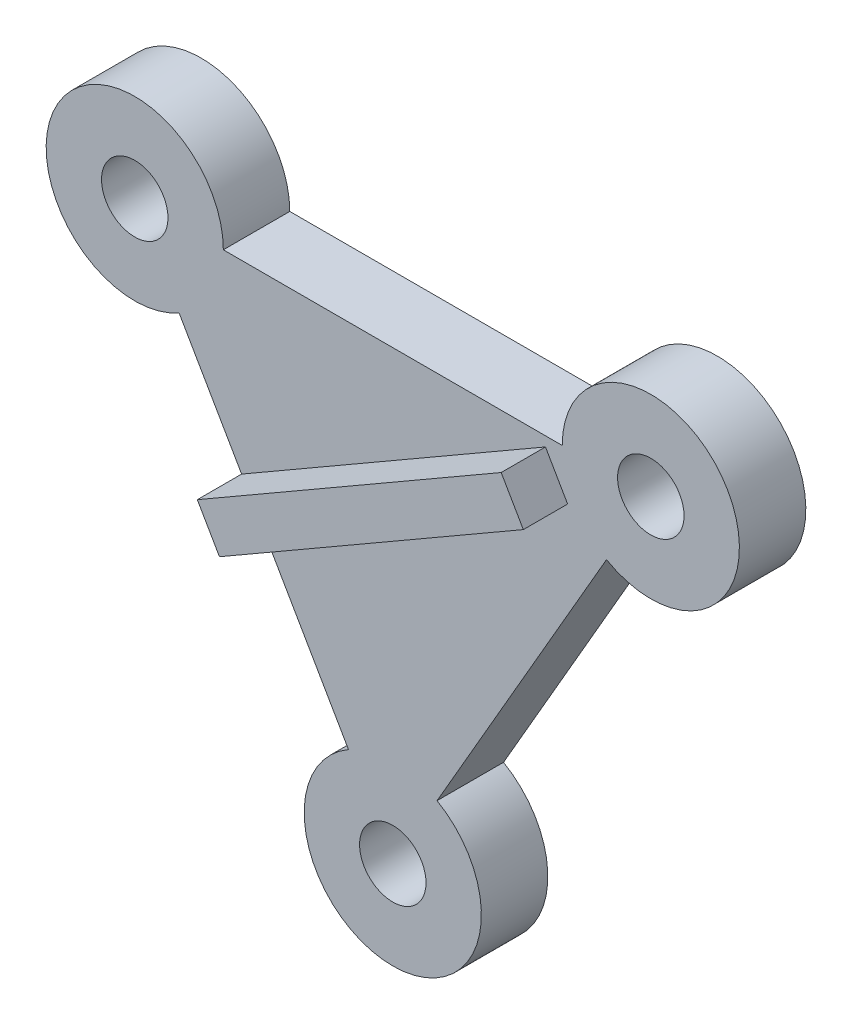
ISO-10303-21;
HEADER;
FILE_DESCRIPTION(('STEP AP214'),'2;1');
FILE_NAME('part.step','',(''),(''),'','','');
FILE_SCHEMA(('AUTOMOTIVE_DESIGN { 1 0 10303 214 1 1 1 1 }'));
ENDSEC;
DATA;
#1=APPLICATION_CONTEXT('core data for automotive mechanical design processes');
#2=APPLICATION_PROTOCOL_DEFINITION('international standard','automotive_design',2000,#1);
#3=PRODUCT_CONTEXT('',#1,'mechanical');
#4=PRODUCT('Part','Part','',(#3));
#5=PRODUCT_RELATED_PRODUCT_CATEGORY('part','',(#4));
#6=PRODUCT_DEFINITION_FORMATION('','',#4);
#7=PRODUCT_DEFINITION_CONTEXT('part definition',#1,'design');
#8=PRODUCT_DEFINITION('design','',#6,#7);
#9=PRODUCT_DEFINITION_SHAPE('','',#8);
#10=(LENGTH_UNIT() NAMED_UNIT(*) SI_UNIT(.MILLI.,.METRE.));
#11=(NAMED_UNIT(*) PLANE_ANGLE_UNIT() SI_UNIT($,.RADIAN.));
#12=(NAMED_UNIT(*) SI_UNIT($,.STERADIAN.) SOLID_ANGLE_UNIT());
#13=UNCERTAINTY_MEASURE_WITH_UNIT(LENGTH_MEASURE(1.E-05),#10,'distance_accuracy_value','');
#14=(GEOMETRIC_REPRESENTATION_CONTEXT(3) GLOBAL_UNCERTAINTY_ASSIGNED_CONTEXT((#13)) GLOBAL_UNIT_ASSIGNED_CONTEXT((#10,
#11,#12)) REPRESENTATION_CONTEXT('',''));
#15=CARTESIAN_POINT('',(0.,0.,0.));
#16=DIRECTION('',(0.,0.,1.));
#17=DIRECTION('',(1.,0.,0.));
#18=AXIS2_PLACEMENT_3D('',#15,#16,#17);
#19=CARTESIAN_POINT('',(-17.7830320131369,30.8264952926154,3.));
#20=DIRECTION('',(0.,0.,1.));
#21=DIRECTION('',(1.,0.,0.));
#22=AXIS2_PLACEMENT_3D('',#19,#20,#21);
#23=PLANE('',#22);
#24=DIRECTION('',(0.866025403784439,0.5,0.));
#25=VECTOR('',#24,1.);
#26=CARTESIAN_POINT('',(1.76091941911627,28.6579396409374,3.));
#27=LINE('',#26,#25);
#28=CARTESIAN_POINT('',(-11.9580320131369,20.7372993385267,3.));
#29=VERTEX_POINT('',#28);
#30=CARTESIAN_POINT('',(1.76091941911627,28.6579396409374,3.));
#31=VERTEX_POINT('',#30);
#32=EDGE_CURVE('E57',#29,#31,#27,.T.);
#33=ORIENTED_EDGE('',*,*,#32,.F.);
#34=DIRECTION('',(0.5,-0.866025403784439,0.));
#35=VECTOR('',#34,1.);
#36=CARTESIAN_POINT('',(-15.7830320131369,27.3623936774776,3.));
#37=LINE('',#36,#35);
#38=CARTESIAN_POINT('',(-8.1330320131369,14.1122049995757,3.));
#39=VERTEX_POINT('',#38);
#40=EDGE_CURVE('E161',#29,#39,#37,.T.);
#41=ORIENTED_EDGE('',*,*,#40,.T.);
#42=CARTESIAN_POINT('',(-6.1330320131369,10.648103384438,3.));
#43=DIRECTION('',(0.,0.,1.));
#44=DIRECTION('',(-1.,0.,0.));
#45=AXIS2_PLACEMENT_3D('',#42,#43,#44);
#46=CIRCLE('',#45,4.);
#47=CARTESIAN_POINT('',(-4.13303201313691,14.1122049995757,3.));
#48=VERTEX_POINT('',#47);
#49=EDGE_CURVE('E165',#39,#48,#46,.T.);
#50=ORIENTED_EDGE('',*,*,#49,.T.);
#51=DIRECTION('',(0.5,0.866025403784439,0.));
#52=VECTOR('',#51,1.);
#53=CARTESIAN_POINT('',(3.51696798686309,27.3623936774776,3.));
#54=LINE('',#53,#52);
#55=CARTESIAN_POINT('',(3.51696798686309,27.3623936774776,3.));
#56=VERTEX_POINT('',#55);
#57=EDGE_CURVE('E201',#48,#56,#54,.T.);
#58=ORIENTED_EDGE('',*,*,#57,.T.);
#59=CARTESIAN_POINT('',(5.5169679868631,30.8264952926154,3.));
#60=DIRECTION('',(0.,0.,1.));
#61=DIRECTION('',(-1.,0.,0.));
#62=AXIS2_PLACEMENT_3D('',#59,#60,#61);
#63=CIRCLE('',#62,4.);
#64=CARTESIAN_POINT('',(1.5169679868631,30.8264952926154,3.));
#65=VERTEX_POINT('',#64);
#66=EDGE_CURVE('E200',#56,#65,#63,.T.);
#67=ORIENTED_EDGE('',*,*,#66,.T.);
#68=DIRECTION('',(-1.,0.,0.));
#69=VECTOR('',#68,1.);
#70=CARTESIAN_POINT('',(-13.7830320131369,30.8264952926154,3.));
#71=LINE('',#70,#69);
#72=CARTESIAN_POINT('',(-13.7830320131369,30.8264952926154,3.));
#73=VERTEX_POINT('',#72);
#74=EDGE_CURVE('E187',#65,#73,#71,.T.);
#75=ORIENTED_EDGE('',*,*,#74,.T.);
#76=CARTESIAN_POINT('',(-17.7830320131369,30.8264952926154,3.));
#77=DIRECTION('',(0.,0.,1.));
#78=DIRECTION('',(1.,0.,0.));
#79=AXIS2_PLACEMENT_3D('',#76,#77,#78);
#80=CIRCLE('',#79,4.);
#81=CARTESIAN_POINT('',(-15.7830320131369,27.3623936774776,3.));
#82=VERTEX_POINT('',#81);
#83=EDGE_CURVE('E158',#73,#82,#80,.T.);
#84=ORIENTED_EDGE('',*,*,#83,.T.);
#85=CARTESIAN_POINT('',(-12.9580320131369,22.4693501460956,3.));
#86=VERTEX_POINT('',#85);
#87=EDGE_CURVE('E171',#82,#86,#37,.T.);
#88=ORIENTED_EDGE('',*,*,#87,.T.);
#89=DIRECTION('',(-0.866025403784439,-0.5,0.));
#90=VECTOR('',#89,1.);
#91=CARTESIAN_POINT('',(-12.9580320131369,22.4693501460956,3.));
#92=LINE('',#91,#90);
#93=CARTESIAN_POINT('',(0.760919419116271,30.3899904485063,3.));
#94=VERTEX_POINT('',#93);
#95=EDGE_CURVE('E131',#94,#86,#92,.T.);
#96=ORIENTED_EDGE('',*,*,#95,.F.);
#97=DIRECTION('',(-0.499999999999999,0.866025403784439,0.));
#98=VECTOR('',#97,1.);
#99=CARTESIAN_POINT('',(0.760919419116271,30.3899904485063,3.));
#100=LINE('',#99,#98);
#101=EDGE_CURVE('E52',#31,#94,#100,.T.);
#102=ORIENTED_EDGE('',*,*,#101,.F.);
#103=EDGE_LOOP('',(#33,#41,#50,#58,#67,#75,#84,#88,#96,#102));
#104=FACE_BOUND('',#103,.T.);
#105=CARTESIAN_POINT('',(5.5169679868631,30.8264952926154,3.));
#106=DIRECTION('',(0.,0.,1.));
#107=DIRECTION('',(1.,0.,0.));
#108=AXIS2_PLACEMENT_3D('',#105,#106,#107);
#109=CIRCLE('',#108,1.5);
#110=CARTESIAN_POINT('',(7.01696798686309,30.8264952926154,3.));
#111=VERTEX_POINT('',#110);
#112=EDGE_CURVE('E146',#111,#111,#109,.T.);
#113=ORIENTED_EDGE('',*,*,#112,.F.);
#114=EDGE_LOOP('',(#113));
#115=FACE_BOUND('',#114,.T.);
#116=CARTESIAN_POINT('',(-17.7830320131369,30.8264952926154,3.));
#117=DIRECTION('',(0.,0.,1.));
#118=DIRECTION('',(1.,0.,0.));
#119=AXIS2_PLACEMENT_3D('',#116,#117,#118);
#120=CIRCLE('',#119,1.5);
#121=CARTESIAN_POINT('',(-16.2830320131369,30.8264952926154,3.));
#122=VERTEX_POINT('',#121);
#123=EDGE_CURVE('E152',#122,#122,#120,.T.);
#124=ORIENTED_EDGE('',*,*,#123,.F.);
#125=EDGE_LOOP('',(#124));
#126=FACE_BOUND('',#125,.T.);
#127=CARTESIAN_POINT('',(-6.1330320131369,10.648103384438,3.));
#128=DIRECTION('',(0.,0.,1.));
#129=DIRECTION('',(1.,0.,0.));
#130=AXIS2_PLACEMENT_3D('',#127,#128,#129);
#131=CIRCLE('',#130,1.5);
#132=CARTESIAN_POINT('',(-4.6330320131369,10.648103384438,3.));
#133=VERTEX_POINT('',#132);
#134=EDGE_CURVE('E137',#133,#133,#131,.T.);
#135=ORIENTED_EDGE('',*,*,#134,.F.);
#136=EDGE_LOOP('',(#135));
#137=FACE_BOUND('',#136,.T.);
#138=ADVANCED_FACE('F35',(#104,#115,#126,#137),#23,.T.);
#139=CARTESIAN_POINT('',(-17.7830320131369,30.8264952926154,0.));
#140=DIRECTION('',(0.,0.,1.));
#141=DIRECTION('',(1.,0.,0.));
#142=AXIS2_PLACEMENT_3D('',#139,#140,#141);
#143=PLANE('',#142);
#144=CARTESIAN_POINT('',(5.5169679868631,30.8264952926154,0.));
#145=DIRECTION('',(0.,0.,1.));
#146=DIRECTION('',(1.,0.,0.));
#147=AXIS2_PLACEMENT_3D('',#144,#145,#146);
#148=CIRCLE('',#147,1.5);
#149=CARTESIAN_POINT('',(7.01696798686309,30.8264952926154,0.));
#150=VERTEX_POINT('',#149);
#151=EDGE_CURVE('E144',#150,#150,#148,.T.);
#152=ORIENTED_EDGE('',*,*,#151,.T.);
#153=EDGE_LOOP('',(#152));
#154=FACE_BOUND('',#153,.T.);
#155=CARTESIAN_POINT('',(-17.7830320131369,30.8264952926154,0.));
#156=DIRECTION('',(0.,0.,1.));
#157=DIRECTION('',(1.,0.,0.));
#158=AXIS2_PLACEMENT_3D('',#155,#156,#157);
#159=CIRCLE('',#158,4.);
#160=CARTESIAN_POINT('',(-13.7830320131369,30.8264952926154,0.));
#161=VERTEX_POINT('',#160);
#162=CARTESIAN_POINT('',(-15.7830320131369,27.3623936774776,0.));
#163=VERTEX_POINT('',#162);
#164=EDGE_CURVE('E155',#161,#163,#159,.T.);
#165=ORIENTED_EDGE('',*,*,#164,.F.);
#166=DIRECTION('',(-1.,0.,0.));
#167=VECTOR('',#166,1.);
#168=CARTESIAN_POINT('',(-13.7830320131369,30.8264952926154,0.));
#169=LINE('',#168,#167);
#170=CARTESIAN_POINT('',(1.5169679868631,30.8264952926154,0.));
#171=VERTEX_POINT('',#170);
#172=EDGE_CURVE('E162',#171,#161,#169,.T.);
#173=ORIENTED_EDGE('',*,*,#172,.F.);
#174=CARTESIAN_POINT('',(5.5169679868631,30.8264952926154,0.));
#175=DIRECTION('',(0.,0.,1.));
#176=DIRECTION('',(-1.,0.,0.));
#177=AXIS2_PLACEMENT_3D('',#174,#175,#176);
#178=CIRCLE('',#177,4.);
#179=CARTESIAN_POINT('',(3.51696798686309,27.3623936774776,0.));
#180=VERTEX_POINT('',#179);
#181=EDGE_CURVE('E189',#180,#171,#178,.T.);
#182=ORIENTED_EDGE('',*,*,#181,.F.);
#183=DIRECTION('',(0.5,0.866025403784439,0.));
#184=VECTOR('',#183,1.);
#185=CARTESIAN_POINT('',(3.51696798686309,27.3623936774776,0.));
#186=LINE('',#185,#184);
#187=CARTESIAN_POINT('',(-4.13303201313691,14.1122049995757,0.));
#188=VERTEX_POINT('',#187);
#189=EDGE_CURVE('E191',#188,#180,#186,.T.);
#190=ORIENTED_EDGE('',*,*,#189,.F.);
#191=CARTESIAN_POINT('',(-6.1330320131369,10.648103384438,0.));
#192=DIRECTION('',(0.,0.,1.));
#193=DIRECTION('',(-1.,0.,0.));
#194=AXIS2_PLACEMENT_3D('',#191,#192,#193);
#195=CIRCLE('',#194,4.);
#196=CARTESIAN_POINT('',(-8.1330320131369,14.1122049995757,0.));
#197=VERTEX_POINT('',#196);
#198=EDGE_CURVE('E193',#197,#188,#195,.T.);
#199=ORIENTED_EDGE('',*,*,#198,.F.);
#200=DIRECTION('',(0.5,-0.866025403784439,0.));
#201=VECTOR('',#200,1.);
#202=CARTESIAN_POINT('',(-15.7830320131369,27.3623936774776,0.));
#203=LINE('',#202,#201);
#204=EDGE_CURVE('E195',#163,#197,#203,.T.);
#205=ORIENTED_EDGE('',*,*,#204,.F.);
#206=EDGE_LOOP('',(#165,#173,#182,#190,#199,#205));
#207=FACE_BOUND('',#206,.T.);
#208=CARTESIAN_POINT('',(-17.7830320131369,30.8264952926154,0.));
#209=DIRECTION('',(0.,0.,1.));
#210=DIRECTION('',(1.,0.,0.));
#211=AXIS2_PLACEMENT_3D('',#208,#209,#210);
#212=CIRCLE('',#211,1.5);
#213=CARTESIAN_POINT('',(-16.2830320131369,30.8264952926154,0.));
#214=VERTEX_POINT('',#213);
#215=EDGE_CURVE('E149',#214,#214,#212,.T.);
#216=ORIENTED_EDGE('',*,*,#215,.T.);
#217=EDGE_LOOP('',(#216));
#218=FACE_BOUND('',#217,.T.);
#219=CARTESIAN_POINT('',(-6.1330320131369,10.648103384438,0.));
#220=DIRECTION('',(0.,0.,1.));
#221=DIRECTION('',(1.,0.,0.));
#222=AXIS2_PLACEMENT_3D('',#219,#220,#221);
#223=CIRCLE('',#222,1.5);
#224=CARTESIAN_POINT('',(-4.6330320131369,10.648103384438,0.));
#225=VERTEX_POINT('',#224);
#226=EDGE_CURVE('E134',#225,#225,#223,.T.);
#227=ORIENTED_EDGE('',*,*,#226,.T.);
#228=EDGE_LOOP('',(#227));
#229=FACE_BOUND('',#228,.T.);
#230=ADVANCED_FACE('F247',(#154,#207,#218,#229),#143,.F.);
#231=CARTESIAN_POINT('',(-17.7830320131369,30.8264952926154,3.));
#232=DIRECTION('',(0.,0.,-1.));
#233=DIRECTION('',(-1.,0.,0.));
#234=AXIS2_PLACEMENT_3D('',#231,#232,#233);
#235=CYLINDRICAL_SURFACE('',#234,4.);
#236=ORIENTED_EDGE('',*,*,#164,.T.);
#237=DIRECTION('',(0.,0.,-1.));
#238=VECTOR('',#237,1.);
#239=CARTESIAN_POINT('',(-15.7830320131369,27.3623936774776,3.));
#240=LINE('',#239,#238);
#241=EDGE_CURVE('E11',#82,#163,#240,.T.);
#242=ORIENTED_EDGE('',*,*,#241,.F.);
#243=ORIENTED_EDGE('',*,*,#83,.F.);
#244=DIRECTION('',(0.,0.,-1.));
#245=VECTOR('',#244,1.);
#246=CARTESIAN_POINT('',(-13.7830320131369,30.8264952926154,3.));
#247=LINE('',#246,#245);
#248=EDGE_CURVE('E184',#73,#161,#247,.T.);
#249=ORIENTED_EDGE('',*,*,#248,.T.);
#250=EDGE_LOOP('',(#236,#242,#243,#249));
#251=FACE_BOUND('',#250,.T.);
#252=ADVANCED_FACE('F37',(#251),#235,.T.);
#253=CARTESIAN_POINT('',(-15.7830320131369,27.3623936774776,3.));
#254=DIRECTION('',(0.866025403784438,0.5,0.));
#255=DIRECTION('',(-0.5,0.866025403784439,0.));
#256=AXIS2_PLACEMENT_3D('',#253,#254,#255);
#257=PLANE('',#256);
#258=ORIENTED_EDGE('',*,*,#204,.T.);
#259=DIRECTION('',(0.,0.,-1.));
#260=VECTOR('',#259,1.);
#261=CARTESIAN_POINT('',(-8.1330320131369,14.1122049995757,3.));
#262=LINE('',#261,#260);
#263=EDGE_CURVE('E44',#39,#197,#262,.T.);
#264=ORIENTED_EDGE('',*,*,#263,.F.);
#265=ORIENTED_EDGE('',*,*,#40,.F.);
#266=DIRECTION('',(0.,0.,-1.));
#267=VECTOR('',#266,1.);
#268=CARTESIAN_POINT('',(-11.9580320131369,20.7372993385267,5.));
#269=LINE('',#268,#267);
#270=CARTESIAN_POINT('',(-11.9580320131369,20.7372993385267,5.));
#271=VERTEX_POINT('',#270);
#272=EDGE_CURVE('E243',#271,#29,#269,.T.);
#273=ORIENTED_EDGE('',*,*,#272,.F.);
#274=DIRECTION('',(0.5,-0.866025403784439,0.));
#275=VECTOR('',#274,1.);
#276=CARTESIAN_POINT('',(-11.9580320131369,20.7372993385267,5.));
#277=LINE('',#276,#275);
#278=CARTESIAN_POINT('',(-12.9580320131369,22.4693501460956,5.));
#279=VERTEX_POINT('',#278);
#280=EDGE_CURVE('E127',#279,#271,#277,.T.);
#281=ORIENTED_EDGE('',*,*,#280,.F.);
#282=DIRECTION('',(0.,0.,-1.));
#283=VECTOR('',#282,1.);
#284=CARTESIAN_POINT('',(-12.9580320131369,22.4693501460956,5.));
#285=LINE('',#284,#283);
#286=EDGE_CURVE('E139',#279,#86,#285,.T.);
#287=ORIENTED_EDGE('',*,*,#286,.T.);
#288=ORIENTED_EDGE('',*,*,#87,.F.);
#289=ORIENTED_EDGE('',*,*,#241,.T.);
#290=EDGE_LOOP('',(#258,#264,#265,#273,#281,#287,#288,#289));
#291=FACE_BOUND('',#290,.T.);
#292=ADVANCED_FACE('F229',(#291),#257,.F.);
#293=CARTESIAN_POINT('',(-6.1330320131369,10.648103384438,3.));
#294=DIRECTION('',(0.,0.,-1.));
#295=DIRECTION('',(-1.,0.,0.));
#296=AXIS2_PLACEMENT_3D('',#293,#294,#295);
#297=CYLINDRICAL_SURFACE('',#296,4.);
#298=ORIENTED_EDGE('',*,*,#198,.T.);
#299=DIRECTION('',(0.,0.,-1.));
#300=VECTOR('',#299,1.);
#301=CARTESIAN_POINT('',(-4.13303201313691,14.1122049995757,3.));
#302=LINE('',#301,#300);
#303=EDGE_CURVE('E175',#48,#188,#302,.T.);
#304=ORIENTED_EDGE('',*,*,#303,.F.);
#305=ORIENTED_EDGE('',*,*,#49,.F.);
#306=ORIENTED_EDGE('',*,*,#263,.T.);
#307=EDGE_LOOP('',(#298,#304,#305,#306));
#308=FACE_BOUND('',#307,.T.);
#309=ADVANCED_FACE('F209',(#308),#297,.T.);
#310=CARTESIAN_POINT('',(3.51696798686309,27.3623936774776,3.));
#311=DIRECTION('',(-0.866025403784439,0.5,0.));
#312=DIRECTION('',(-0.5,-0.866025403784439,0.));
#313=AXIS2_PLACEMENT_3D('',#310,#311,#312);
#314=PLANE('',#313);
#315=ORIENTED_EDGE('',*,*,#189,.T.);
#316=DIRECTION('',(0.,0.,-1.));
#317=VECTOR('',#316,1.);
#318=CARTESIAN_POINT('',(3.51696798686309,27.3623936774776,3.));
#319=LINE('',#318,#317);
#320=EDGE_CURVE('E178',#56,#180,#319,.T.);
#321=ORIENTED_EDGE('',*,*,#320,.F.);
#322=ORIENTED_EDGE('',*,*,#57,.F.);
#323=ORIENTED_EDGE('',*,*,#303,.T.);
#324=EDGE_LOOP('',(#315,#321,#322,#323));
#325=FACE_BOUND('',#324,.T.);
#326=ADVANCED_FACE('F213',(#325),#314,.F.);
#327=CARTESIAN_POINT('',(5.5169679868631,30.8264952926154,3.));
#328=DIRECTION('',(0.,0.,-1.));
#329=DIRECTION('',(-1.,0.,0.));
#330=AXIS2_PLACEMENT_3D('',#327,#328,#329);
#331=CYLINDRICAL_SURFACE('',#330,4.);
#332=ORIENTED_EDGE('',*,*,#181,.T.);
#333=DIRECTION('',(0.,0.,-1.));
#334=VECTOR('',#333,1.);
#335=CARTESIAN_POINT('',(1.5169679868631,30.8264952926154,3.));
#336=LINE('',#335,#334);
#337=EDGE_CURVE('E181',#65,#171,#336,.T.);
#338=ORIENTED_EDGE('',*,*,#337,.F.);
#339=ORIENTED_EDGE('',*,*,#66,.F.);
#340=ORIENTED_EDGE('',*,*,#320,.T.);
#341=EDGE_LOOP('',(#332,#338,#339,#340));
#342=FACE_BOUND('',#341,.T.);
#343=ADVANCED_FACE('F218',(#342),#331,.T.);
#344=CARTESIAN_POINT('',(-13.7830320131369,30.8264952926154,3.));
#345=DIRECTION('',(0.,-1.,0.));
#346=DIRECTION('',(1.,0.,0.));
#347=AXIS2_PLACEMENT_3D('',#344,#345,#346);
#348=PLANE('',#347);
#349=ORIENTED_EDGE('',*,*,#172,.T.);
#350=ORIENTED_EDGE('',*,*,#248,.F.);
#351=ORIENTED_EDGE('',*,*,#74,.F.);
#352=ORIENTED_EDGE('',*,*,#337,.T.);
#353=EDGE_LOOP('',(#349,#350,#351,#352));
#354=FACE_BOUND('',#353,.T.);
#355=ADVANCED_FACE('F224',(#354),#348,.F.);
#356=CARTESIAN_POINT('',(-17.7830320131369,30.8264952926154,3.));
#357=DIRECTION('',(0.,0.,-1.));
#358=DIRECTION('',(-1.,0.,0.));
#359=AXIS2_PLACEMENT_3D('',#356,#357,#358);
#360=CYLINDRICAL_SURFACE('',#359,1.5);
#361=ORIENTED_EDGE('',*,*,#123,.T.);
#362=EDGE_LOOP('',(#361));
#363=FACE_BOUND('',#362,.T.);
#364=ORIENTED_EDGE('',*,*,#215,.F.);
#365=EDGE_LOOP('',(#364));
#366=FACE_BOUND('',#365,.T.);
#367=ADVANCED_FACE('F266',(#363,#366),#360,.F.);
#368=CARTESIAN_POINT('',(5.5169679868631,30.8264952926154,3.));
#369=DIRECTION('',(0.,0.,-1.));
#370=DIRECTION('',(-1.,0.,0.));
#371=AXIS2_PLACEMENT_3D('',#368,#369,#370);
#372=CYLINDRICAL_SURFACE('',#371,1.5);
#373=ORIENTED_EDGE('',*,*,#112,.T.);
#374=EDGE_LOOP('',(#373));
#375=FACE_BOUND('',#374,.T.);
#376=ORIENTED_EDGE('',*,*,#151,.F.);
#377=EDGE_LOOP('',(#376));
#378=FACE_BOUND('',#377,.T.);
#379=ADVANCED_FACE('F258',(#375,#378),#372,.F.);
#380=CARTESIAN_POINT('',(-6.1330320131369,10.648103384438,3.));
#381=DIRECTION('',(0.,0.,-1.));
#382=DIRECTION('',(-1.,0.,0.));
#383=AXIS2_PLACEMENT_3D('',#380,#381,#382);
#384=CYLINDRICAL_SURFACE('',#383,1.5);
#385=ORIENTED_EDGE('',*,*,#134,.T.);
#386=EDGE_LOOP('',(#385));
#387=FACE_BOUND('',#386,.T.);
#388=ORIENTED_EDGE('',*,*,#226,.F.);
#389=EDGE_LOOP('',(#388));
#390=FACE_BOUND('',#389,.T.);
#391=ADVANCED_FACE('F256',(#387,#390),#384,.F.);
#392=CARTESIAN_POINT('',(1.76091941911627,28.6579396409374,5.));
#393=DIRECTION('',(-0.5,0.866025403784439,0.));
#394=DIRECTION('',(-0.866025403784439,-0.5,0.));
#395=AXIS2_PLACEMENT_3D('',#392,#393,#394);
#396=PLANE('',#395);
#397=ORIENTED_EDGE('',*,*,#32,.T.);
#398=DIRECTION('',(0.,0.,-1.));
#399=VECTOR('',#398,1.);
#400=CARTESIAN_POINT('',(1.76091941911627,28.6579396409374,5.));
#401=LINE('',#400,#399);
#402=CARTESIAN_POINT('',(1.76091941911627,28.6579396409374,5.));
#403=VERTEX_POINT('',#402);
#404=EDGE_CURVE('E116',#403,#31,#401,.T.);
#405=ORIENTED_EDGE('',*,*,#404,.F.);
#406=DIRECTION('',(0.866025403784439,0.5,0.));
#407=VECTOR('',#406,1.);
#408=CARTESIAN_POINT('',(1.76091941911627,28.6579396409374,5.));
#409=LINE('',#408,#407);
#410=EDGE_CURVE('E122',#271,#403,#409,.T.);
#411=ORIENTED_EDGE('',*,*,#410,.F.);
#412=ORIENTED_EDGE('',*,*,#272,.T.);
#413=EDGE_LOOP('',(#397,#405,#411,#412));
#414=FACE_BOUND('',#413,.T.);
#415=ADVANCED_FACE('F133',(#414),#396,.F.);
#416=CARTESIAN_POINT('',(0.760919419116271,30.3899904485063,5.));
#417=DIRECTION('',(-0.866025403784439,-0.499999999999999,0.));
#418=DIRECTION('',(0.5,-0.866025403784439,0.));
#419=AXIS2_PLACEMENT_3D('',#416,#417,#418);
#420=PLANE('',#419);
#421=ORIENTED_EDGE('',*,*,#101,.T.);
#422=DIRECTION('',(0.,0.,-1.));
#423=VECTOR('',#422,1.);
#424=CARTESIAN_POINT('',(0.760919419116271,30.3899904485063,5.));
#425=LINE('',#424,#423);
#426=CARTESIAN_POINT('',(0.760919419116271,30.3899904485063,5.));
#427=VERTEX_POINT('',#426);
#428=EDGE_CURVE('E118',#427,#94,#425,.T.);
#429=ORIENTED_EDGE('',*,*,#428,.F.);
#430=DIRECTION('',(-0.499999999999999,0.866025403784439,0.));
#431=VECTOR('',#430,1.);
#432=CARTESIAN_POINT('',(0.760919419116271,30.3899904485063,5.));
#433=LINE('',#432,#431);
#434=EDGE_CURVE('E112',#403,#427,#433,.T.);
#435=ORIENTED_EDGE('',*,*,#434,.F.);
#436=ORIENTED_EDGE('',*,*,#404,.T.);
#437=EDGE_LOOP('',(#421,#429,#435,#436));
#438=FACE_BOUND('',#437,.T.);
#439=ADVANCED_FACE('F114',(#438),#420,.F.);
#440=CARTESIAN_POINT('',(-12.9580320131369,22.4693501460956,5.));
#441=DIRECTION('',(0.5,-0.866025403784439,0.));
#442=DIRECTION('',(0.866025403784439,0.5,0.));
#443=AXIS2_PLACEMENT_3D('',#440,#441,#442);
#444=PLANE('',#443);
#445=ORIENTED_EDGE('',*,*,#95,.T.);
#446=ORIENTED_EDGE('',*,*,#286,.F.);
#447=DIRECTION('',(-0.866025403784439,-0.5,0.));
#448=VECTOR('',#447,1.);
#449=CARTESIAN_POINT('',(-12.9580320131369,22.4693501460956,5.));
#450=LINE('',#449,#448);
#451=EDGE_CURVE('E121',#427,#279,#450,.T.);
#452=ORIENTED_EDGE('',*,*,#451,.F.);
#453=ORIENTED_EDGE('',*,*,#428,.T.);
#454=EDGE_LOOP('',(#445,#446,#452,#453));
#455=FACE_BOUND('',#454,.T.);
#456=ADVANCED_FACE('F234',(#455),#444,.F.);
#457=CARTESIAN_POINT('',(0.,0.,5.));
#458=DIRECTION('',(0.,0.,-1.));
#459=DIRECTION('',(-1.,0.,0.));
#460=AXIS2_PLACEMENT_3D('',#457,#458,#459);
#461=PLANE('',#460);
#462=ORIENTED_EDGE('',*,*,#410,.T.);
#463=ORIENTED_EDGE('',*,*,#434,.T.);
#464=ORIENTED_EDGE('',*,*,#451,.T.);
#465=ORIENTED_EDGE('',*,*,#280,.T.);
#466=EDGE_LOOP('',(#462,#463,#464,#465));
#467=FACE_BOUND('',#466,.T.);
#468=ADVANCED_FACE('F125',(#467),#461,.F.);
#469=CLOSED_SHELL('',(#138,#230,#252,#292,#309,#326,#343,#355,#367,#379,#391,#415,#439,#456,#468));
#470=MANIFOLD_SOLID_BREP('B2',#469);
#471=ADVANCED_BREP_SHAPE_REPRESENTATION('',(#18,#470),#14);
#472=SHAPE_DEFINITION_REPRESENTATION(#9,#471);
ENDSEC;
END-ISO-10303-21;
